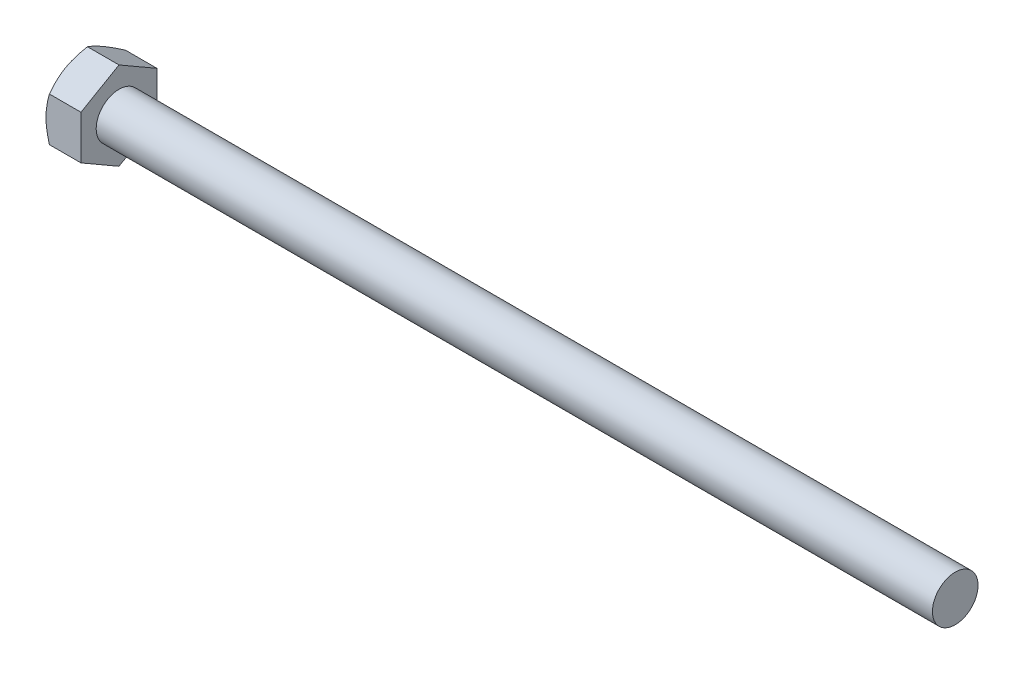
ISO-10303-21;
HEADER;
FILE_DESCRIPTION(('STEP AP214'),'2;1');
FILE_NAME('part.step','',(''),(''),'','','');
FILE_SCHEMA(('AUTOMOTIVE_DESIGN { 1 0 10303 214 1 1 1 1 }'));
ENDSEC;
DATA;
#1=APPLICATION_CONTEXT('core data for automotive mechanical design processes');
#2=APPLICATION_PROTOCOL_DEFINITION('international standard','automotive_design',2000,#1);
#3=PRODUCT_CONTEXT('',#1,'mechanical');
#4=PRODUCT('Part','Part','',(#3));
#5=PRODUCT_RELATED_PRODUCT_CATEGORY('part','',(#4));
#6=PRODUCT_DEFINITION_FORMATION('','',#4);
#7=PRODUCT_DEFINITION_CONTEXT('part definition',#1,'design');
#8=PRODUCT_DEFINITION('design','',#6,#7);
#9=PRODUCT_DEFINITION_SHAPE('','',#8);
#10=(LENGTH_UNIT() NAMED_UNIT(*) SI_UNIT(.MILLI.,.METRE.));
#11=(NAMED_UNIT(*) PLANE_ANGLE_UNIT() SI_UNIT($,.RADIAN.));
#12=(NAMED_UNIT(*) SI_UNIT($,.STERADIAN.) SOLID_ANGLE_UNIT());
#13=UNCERTAINTY_MEASURE_WITH_UNIT(LENGTH_MEASURE(1.E-05),#10,'distance_accuracy_value','');
#14=(GEOMETRIC_REPRESENTATION_CONTEXT(3) GLOBAL_UNCERTAINTY_ASSIGNED_CONTEXT((#13)) GLOBAL_UNIT_ASSIGNED_CONTEXT((#10,
#11,#12)) REPRESENTATION_CONTEXT('',''));
#15=CARTESIAN_POINT('',(0.,0.,0.));
#16=DIRECTION('',(0.,0.,1.));
#17=DIRECTION('',(1.,0.,0.));
#18=AXIS2_PLACEMENT_3D('',#15,#16,#17);
#19=CARTESIAN_POINT('',(2.3,1.5,0.));
#20=DIRECTION('',(-1.,0.,0.));
#21=DIRECTION('',(0.,0.,1.));
#22=AXIS2_PLACEMENT_3D('',#19,#20,#21);
#23=PLANE('',#22);
#24=CARTESIAN_POINT('',(2.3,0.,0.));
#25=DIRECTION('',(-1.,0.,0.));
#26=DIRECTION('',(0.,0.,1.));
#27=AXIS2_PLACEMENT_3D('',#24,#25,#26);
#28=CIRCLE('',#27,1.5);
#29=CARTESIAN_POINT('',(2.3,0.,1.5));
#30=VERTEX_POINT('',#29);
#31=EDGE_CURVE('E199',#30,#30,#28,.T.);
#32=ORIENTED_EDGE('',*,*,#31,.T.);
#33=EDGE_LOOP('',(#32));
#34=FACE_BOUND('',#33,.T.);
#35=DIRECTION('',(0.,1.,0.));
#36=VECTOR('',#35,1.);
#37=CARTESIAN_POINT('',(2.3,-1.44337567928133,2.5));
#38=LINE('',#37,#36);
#39=CARTESIAN_POINT('',(2.3,-1.44337567928133,2.5));
#40=VERTEX_POINT('',#39);
#41=CARTESIAN_POINT('',(2.3,1.44337567928159,2.5));
#42=VERTEX_POINT('',#41);
#43=EDGE_CURVE('E59',#40,#42,#38,.T.);
#44=ORIENTED_EDGE('',*,*,#43,.F.);
#45=DIRECTION('',(0.,0.50000000163871,0.866025402838329));
#46=VECTOR('',#45,1.);
#47=CARTESIAN_POINT('',(2.3,-2.8867513585628,0.));
#48=LINE('',#47,#46);
#49=CARTESIAN_POINT('',(2.3,-2.8867513585628,0.));
#50=VERTEX_POINT('',#49);
#51=EDGE_CURVE('E132',#50,#40,#48,.T.);
#52=ORIENTED_EDGE('',*,*,#51,.F.);
#53=DIRECTION('',(0.,-0.50000000163871,0.866025402838329));
#54=VECTOR('',#53,1.);
#55=CARTESIAN_POINT('',(2.3,-1.44337567928133,-2.5));
#56=LINE('',#55,#54);
#57=CARTESIAN_POINT('',(2.3,-1.44337567928133,-2.5));
#58=VERTEX_POINT('',#57);
#59=EDGE_CURVE('E130',#58,#50,#56,.T.);
#60=ORIENTED_EDGE('',*,*,#59,.F.);
#61=DIRECTION('',(0.,-1.,0.));
#62=VECTOR('',#61,1.);
#63=CARTESIAN_POINT('',(2.3,1.44337567928159,-2.5));
#64=LINE('',#63,#62);
#65=CARTESIAN_POINT('',(2.3,1.44337567928159,-2.5));
#66=VERTEX_POINT('',#65);
#67=EDGE_CURVE('E113',#66,#58,#64,.T.);
#68=ORIENTED_EDGE('',*,*,#67,.F.);
#69=DIRECTION('',(0.,-0.50000000163871,-0.866025402838329));
#70=VECTOR('',#69,1.);
#71=CARTESIAN_POINT('',(2.3,2.88675135856305,0.));
#72=LINE('',#71,#70);
#73=CARTESIAN_POINT('',(2.3,2.88675135856305,0.));
#74=VERTEX_POINT('',#73);
#75=EDGE_CURVE('E122',#74,#66,#72,.T.);
#76=ORIENTED_EDGE('',*,*,#75,.F.);
#77=DIRECTION('',(0.,0.50000000163871,-0.866025402838329));
#78=VECTOR('',#77,1.);
#79=CARTESIAN_POINT('',(2.3,1.44337567928159,2.5));
#80=LINE('',#79,#78);
#81=EDGE_CURVE('E126',#42,#74,#80,.T.);
#82=ORIENTED_EDGE('',*,*,#81,.F.);
#83=EDGE_LOOP('',(#44,#52,#60,#68,#76,#82));
#84=FACE_BOUND('',#83,.T.);
#85=ADVANCED_FACE('F36',(#34,#84),#23,.F.);
#86=CARTESIAN_POINT('',(-25.4,0.,0.));
#87=DIRECTION('',(-1.,0.,0.));
#88=DIRECTION('',(0.,0.,1.));
#89=AXIS2_PLACEMENT_3D('',#86,#87,#88);
#90=CYLINDRICAL_SURFACE('',#89,1.5);
#91=CARTESIAN_POINT('',(57.3,0.,0.));
#92=DIRECTION('',(-1.,0.,0.));
#93=DIRECTION('',(0.,0.,1.));
#94=AXIS2_PLACEMENT_3D('',#91,#92,#93);
#95=CIRCLE('',#94,1.5);
#96=CARTESIAN_POINT('',(57.3,0.,1.5));
#97=VERTEX_POINT('',#96);
#98=EDGE_CURVE('E11',#97,#97,#95,.T.);
#99=ORIENTED_EDGE('',*,*,#98,.T.);
#100=EDGE_LOOP('',(#99));
#101=FACE_BOUND('',#100,.T.);
#102=ORIENTED_EDGE('',*,*,#31,.F.);
#103=EDGE_LOOP('',(#102));
#104=FACE_BOUND('',#103,.T.);
#105=ADVANCED_FACE('F38',(#101,#104),#90,.T.);
#106=CARTESIAN_POINT('',(57.3,1.5,0.));
#107=DIRECTION('',(1.,0.,0.));
#108=DIRECTION('',(0.,0.,-1.));
#109=AXIS2_PLACEMENT_3D('',#106,#107,#108);
#110=PLANE('',#109);
#111=ORIENTED_EDGE('',*,*,#98,.F.);
#112=EDGE_LOOP('',(#111));
#113=FACE_BOUND('',#112,.T.);
#114=ADVANCED_FACE('F180',(#113),#110,.T.);
#115=CARTESIAN_POINT('',(2.3,-1.44337567928133,2.5));
#116=DIRECTION('',(0.,0.,1.));
#117=DIRECTION('',(0.,-1.,0.));
#118=AXIS2_PLACEMENT_3D('',#115,#116,#117);
#119=PLANE('',#118);
#120=DIRECTION('',(-1.,0.,0.));
#121=VECTOR('',#120,1.);
#122=CARTESIAN_POINT('',(2.3,-1.44337567928133,2.5));
#123=LINE('',#122,#121);
#124=CARTESIAN_POINT('',(0.223290995513354,-1.44337567928133,2.5));
#125=VERTEX_POINT('',#124);
#126=EDGE_CURVE('E139',#40,#125,#123,.T.);
#127=ORIENTED_EDGE('',*,*,#126,.F.);
#128=ORIENTED_EDGE('',*,*,#43,.T.);
#129=DIRECTION('',(-1.,0.,0.));
#130=VECTOR('',#129,1.);
#131=CARTESIAN_POINT('',(2.3,1.44337567928159,2.5));
#132=LINE('',#131,#130);
#133=CARTESIAN_POINT('',(0.223290995513429,1.44337567928159,2.5));
#134=VERTEX_POINT('',#133);
#135=EDGE_CURVE('E138',#42,#134,#132,.T.);
#136=ORIENTED_EDGE('',*,*,#135,.T.);
#137=CARTESIAN_POINT('',(1.19632004406595,-3.82805178069449,2.5));
#138=CARTESIAN_POINT('',(1.14327589629636,-3.7182875906123,2.5));
#139=CARTESIAN_POINT('',(1.09075904917703,-3.60826388251005,2.5));
#140=CARTESIAN_POINT('',(0.987081273872628,-3.38755710903453,2.5));
#141=CARTESIAN_POINT('',(0.935920580448254,-3.27687393351173,2.5));
#142=CARTESIAN_POINT('',(0.834986914311904,-3.05411000573681,2.5));
#143=CARTESIAN_POINT('',(0.785223558317014,-2.94202488038616,2.5));
#144=CARTESIAN_POINT('',(0.687834293242499,-2.71693339089507,2.5));
#145=CARTESIAN_POINT('',(0.64020827274816,-2.60392707513802,2.5));
#146=CARTESIAN_POINT('',(0.547096599216495,-2.37541055612811,2.5));
#147=CARTESIAN_POINT('',(0.501644402476205,-2.25988664554279,2.5));
#148=CARTESIAN_POINT('',(0.414299798759198,-2.02747621227372,2.5));
#149=CARTESIAN_POINT('',(0.372407787833691,-1.91058953963062,2.5));
#150=CARTESIAN_POINT('',(0.293309177636011,-1.67550769213624,2.5));
#151=CARTESIAN_POINT('',(0.25609261725792,-1.55731590352552,2.5));
#152=CARTESIAN_POINT('',(0.187553577101156,-1.31925207497197,2.5));
#153=CARTESIAN_POINT('',(0.156229233411223,-1.19938057931484,2.5));
#154=CARTESIAN_POINT('',(0.100995335359192,-0.957875466950475,2.5));
#155=CARTESIAN_POINT('',(0.0770877549190804,-0.836241390144261,2.5));
#156=CARTESIAN_POINT('',(0.0382970673549973,-0.591506739851933,2.5));
#157=CARTESIAN_POINT('',(0.0234139682023207,-0.468406165070562,2.5));
#158=CARTESIAN_POINT('',(0.00398887707067176,-0.222162283708564,2.5));
#159=CARTESIAN_POINT('',(-0.000618582954530851,-0.0990242760150258,2.5));
#160=CARTESIAN_POINT('',(0.000752385125691248,0.147165525321938,2.5));
#161=CARTESIAN_POINT('',(0.00672806531326748,0.270217333048273,2.5));
#162=CARTESIAN_POINT('',(0.0255487226845901,0.480345911839685,2.5));
#163=CARTESIAN_POINT('',(0.0359427194182765,0.567654504214298,2.5));
#164=CARTESIAN_POINT('',(0.0613825749513618,0.741597260879313,2.5));
#165=CARTESIAN_POINT('',(0.0764291673933814,0.828231316595431,2.5));
#166=CARTESIAN_POINT('',(0.127758160854863,1.0870510539617,2.5));
#167=CARTESIAN_POINT('',(0.170216562336702,1.258023566365,2.5));
#168=CARTESIAN_POINT('',(0.243445888381077,1.51385794210056,2.5));
#169=CARTESIAN_POINT('',(0.269819264012639,1.60005333907683,2.5));
#170=CARTESIAN_POINT('',(0.325175689355996,1.7715444847852,2.5));
#171=CARTESIAN_POINT('',(0.354156939094442,1.8568408093229,2.5));
#172=CARTESIAN_POINT('',(0.414126062328043,2.02617712827433,2.5));
#173=CARTESIAN_POINT('',(0.445101723039576,2.11022149180121,2.5));
#174=CARTESIAN_POINT('',(0.508871156887617,2.27765814571535,2.5));
#175=CARTESIAN_POINT('',(0.541665664837585,2.36105015679791,2.5));
#176=CARTESIAN_POINT('',(0.575190110848553,2.44414064056434,2.5));
#177=B_SPLINE_CURVE_WITH_KNOTS('',3,(#137,#138,#139,#140,#141,#142,#143,#144,#145,#146,#147,
#148,#149,#150,#151,#152,#153,#154,#155,#156,#157,#158,#159,#160,#161,#162,#163,#164,#165,#166,
#167,#168,#169,#170,#171,#172,#173,#174,#175,#176),.UNSPECIFIED.,.F.,.F.,(4,2,2,2,2,2,2,2,2,2,2,
2,2,2,2,2,2,2,2,4),(0.,0.365732583178816,0.731528069426235,1.0994168436567,1.46728641830588,
1.83967239293614,2.21209973939173,2.58371966044213,2.95522182687511,3.32682278147237,
3.69842406430308,4.06765095845392,4.43678199670504,4.70042859172476,4.96411678096691,
5.49188560395094,5.76228383952689,6.03249685521827,6.30118893346184,6.56999036530353),.UNSPECIFIED.);
#178=CARTESIAN_POINT('',(0.,0.,2.5));
#179=VERTEX_POINT('',#178);
#180=EDGE_CURVE('E182',#179,#134,#177,.T.);
#181=ORIENTED_EDGE('',*,*,#180,.F.);
#182=EDGE_CURVE('E190',#125,#179,#177,.T.);
#183=ORIENTED_EDGE('',*,*,#182,.F.);
#184=EDGE_LOOP('',(#127,#128,#136,#181,#183));
#185=FACE_BOUND('',#184,.T.);
#186=ADVANCED_FACE('F176',(#185),#119,.T.);
#187=CARTESIAN_POINT('',(2.3,-2.8867513585628,0.));
#188=DIRECTION('',(0.,-0.866025402838329,0.500000001638711));
#189=DIRECTION('',(0.,-0.500000001638711,-0.866025402838329));
#190=AXIS2_PLACEMENT_3D('',#187,#188,#189);
#191=PLANE('',#190);
#192=DIRECTION('',(-1.,0.,0.));
#193=VECTOR('',#192,1.);
#194=CARTESIAN_POINT('',(2.3,-2.8867513585628,0.));
#195=LINE('',#194,#193);
#196=CARTESIAN_POINT('',(0.223291000975683,-2.8867513585628,0.));
#197=VERTEX_POINT('',#196);
#198=EDGE_CURVE('E143',#50,#197,#195,.T.);
#199=ORIENTED_EDGE('',*,*,#198,.F.);
#200=ORIENTED_EDGE('',*,*,#51,.T.);
#201=ORIENTED_EDGE('',*,*,#126,.T.);
#202=CARTESIAN_POINT('',(0.223357671642481,-2.88686682861714,-0.000199999999997055));
#203=CARTESIAN_POINT('',(0.186721627123144,-2.823437260003,0.109663235061774));
#204=CARTESIAN_POINT('',(0.153402225713998,-2.75946017255779,0.220474800552927));
#205=CARTESIAN_POINT('',(0.0952422917887059,-2.63039811834957,0.444016834793913));
#206=CARTESIAN_POINT('',(0.0704223351272887,-2.5653108579734,0.556751276198274));
#207=CARTESIAN_POINT('',(0.0317856569546165,-2.43594298952786,0.780822996233662));
#208=CARTESIAN_POINT('',(0.0177118014837245,-2.37168228872263,0.892125794471919));
#209=CARTESIAN_POINT('',(0.000909157269638142,-2.24285844798616,1.1152552308786));
#210=CARTESIAN_POINT('',(-0.0018335440453357,-2.17829577643781,1.22708105778404));
#211=CARTESIAN_POINT('',(0.00386576449219316,-2.05765213161006,1.43604197932287));
#212=CARTESIAN_POINT('',(0.0109083986955485,-2.00155311785805,1.53320832097125));
#213=CARTESIAN_POINT('',(0.0332314230427739,-1.88972058300822,1.72690795242393));
#214=CARTESIAN_POINT('',(0.0485194421325141,-1.83398744884957,1.82344057202992));
#215=CARTESIAN_POINT('',(0.0867390970453044,-1.7219242510559,2.01753972341901));
#216=CARTESIAN_POINT('',(0.109832779058663,-1.66560837412358,2.11508168311234));
#217=CARTESIAN_POINT('',(0.162246658960904,-1.55381666130744,2.3087106087289));
#218=CARTESIAN_POINT('',(0.191554537725398,-1.49833939269559,2.40480005620986));
#219=CARTESIAN_POINT('',(0.223357666179496,-1.44326020922699,2.5002));
#220=B_SPLINE_CURVE_WITH_KNOTS('',3,(#202,#203,#204,#205,#206,#207,#208,#209,#210,#211,#212,
#213,#214,#215,#216,#217,#218,#219),.UNSPECIFIED.,.F.,.F.,(4,2,2,2,2,2,2,2,4),(0.,
0.396285829073731,0.793524333587547,1.18093087363639,1.56786160813528,1.90479742383017,
2.24204552159359,2.58677531937551,2.93082800409491),.UNSPECIFIED.);
#221=CARTESIAN_POINT('',(0.,-2.16506351419155,1.2500000081935));
#222=VERTEX_POINT('',#221);
#223=EDGE_CURVE('E192',#222,#125,#220,.T.);
#224=ORIENTED_EDGE('',*,*,#223,.F.);
#225=EDGE_CURVE('E191',#197,#222,#220,.T.);
#226=ORIENTED_EDGE('',*,*,#225,.F.);
#227=EDGE_LOOP('',(#199,#200,#201,#224,#226));
#228=FACE_BOUND('',#227,.T.);
#229=ADVANCED_FACE('F179',(#228),#191,.T.);
#230=CARTESIAN_POINT('',(2.3,-1.44337567928133,-2.5));
#231=DIRECTION('',(0.,-0.866025402838329,-0.50000000163871));
#232=DIRECTION('',(0.,0.50000000163871,-0.866025402838329));
#233=AXIS2_PLACEMENT_3D('',#230,#231,#232);
#234=PLANE('',#233);
#235=DIRECTION('',(-1.,0.,0.));
#236=VECTOR('',#235,1.);
#237=CARTESIAN_POINT('',(2.3,-1.44337567928133,-2.5));
#238=LINE('',#237,#236);
#239=CARTESIAN_POINT('',(0.223290995513354,-1.44337567928133,-2.5));
#240=VERTEX_POINT('',#239);
#241=EDGE_CURVE('E119',#58,#240,#238,.T.);
#242=ORIENTED_EDGE('',*,*,#241,.F.);
#243=ORIENTED_EDGE('',*,*,#59,.T.);
#244=ORIENTED_EDGE('',*,*,#198,.T.);
#245=CARTESIAN_POINT('',(0.223357666179496,-1.44326020922699,-2.5002));
#246=CARTESIAN_POINT('',(0.186721622105297,-1.5066897776876,-2.39033676520415));
#247=CARTESIAN_POINT('',(0.153402221169772,-1.57066686497833,-2.27952519998057));
#248=CARTESIAN_POINT('',(0.0952422882291764,-1.69972891886277,-2.05598316630038));
#249=CARTESIAN_POINT('',(0.0704223320783219,-1.76481617906955,-1.94324872518942));
#250=CARTESIAN_POINT('',(0.0317856549217424,-1.89418404716996,-1.71917700575181));
#251=CARTESIAN_POINT('',(0.0177117999573057,-1.95844474779998,-1.60787420781702));
#252=CARTESIAN_POINT('',(0.00090915671970467,-2.08726858816535,-1.38474477205312));
#253=CARTESIAN_POINT('',(-0.00183354412493002,-2.15183125951782,-1.27291894548693));
#254=CARTESIAN_POINT('',(0.00386576523131279,-2.27247490433789,-1.0639580239614));
#255=CARTESIAN_POINT('',(0.0109083998520694,-2.3285739182796,-0.966791681984465));
#256=CARTESIAN_POINT('',(0.0332314250552663,-2.44040645349358,-0.773092049901063));
#257=CARTESIAN_POINT('',(0.048519444583664,-2.49613958782666,-0.676559429992934));
#258=CARTESIAN_POINT('',(0.0867391003778061,-2.60820278596567,-0.48246027800571));
#259=CARTESIAN_POINT('',(0.109832782834311,-2.66451866306856,-0.384918318016938));
#260=CARTESIAN_POINT('',(0.162246663600414,-2.77631037621612,-0.191289391826346));
#261=CARTESIAN_POINT('',(0.19155454278545,-2.83178764498885,-0.0951999440667246));
#262=CARTESIAN_POINT('',(0.223357671642481,-2.88686682861714,0.000200000000003285));
#263=B_SPLINE_CURVE_WITH_KNOTS('',3,(#245,#246,#247,#248,#249,#250,#251,#252,#253,#254,#255,
#256,#257,#258,#259,#260,#261,#262),.UNSPECIFIED.,.F.,.F.,(4,2,2,2,2,2,2,2,4),(0.,
0.396285827816312,0.793524331042151,1.18093086988015,1.56786160317875,1.90479742008592,
2.24204551906553,2.58677531811864,2.9308280040949),.UNSPECIFIED.);
#264=CARTESIAN_POINT('',(0.,-2.16506351419155,-1.25000000819349));
#265=VERTEX_POINT('',#264);
#266=EDGE_CURVE('E222',#265,#197,#263,.T.);
#267=ORIENTED_EDGE('',*,*,#266,.F.);
#268=EDGE_CURVE('E227',#240,#265,#263,.T.);
#269=ORIENTED_EDGE('',*,*,#268,.F.);
#270=EDGE_LOOP('',(#242,#243,#244,#267,#269));
#271=FACE_BOUND('',#270,.T.);
#272=ADVANCED_FACE('F298',(#271),#234,.T.);
#273=CARTESIAN_POINT('',(2.3,1.44337567928159,-2.5));
#274=DIRECTION('',(0.,0.,-1.));
#275=DIRECTION('',(0.,1.,0.));
#276=AXIS2_PLACEMENT_3D('',#273,#274,#275);
#277=PLANE('',#276);
#278=DIRECTION('',(-1.,0.,0.));
#279=VECTOR('',#278,1.);
#280=CARTESIAN_POINT('',(2.3,1.44337567928159,-2.5));
#281=LINE('',#280,#279);
#282=CARTESIAN_POINT('',(0.223290995513426,1.44337567928159,-2.5));
#283=VERTEX_POINT('',#282);
#284=EDGE_CURVE('E108',#66,#283,#281,.T.);
#285=ORIENTED_EDGE('',*,*,#284,.F.);
#286=ORIENTED_EDGE('',*,*,#67,.T.);
#287=ORIENTED_EDGE('',*,*,#241,.T.);
#288=CARTESIAN_POINT('',(1.19632004406595,-3.82805178069449,-2.5));
#289=CARTESIAN_POINT('',(1.14327589629636,-3.71828759061229,-2.5));
#290=CARTESIAN_POINT('',(1.09075904917703,-3.60826388251005,-2.5));
#291=CARTESIAN_POINT('',(0.987081273872629,-3.38755710903453,-2.5));
#292=CARTESIAN_POINT('',(0.935920580448254,-3.27687393351173,-2.5));
#293=CARTESIAN_POINT('',(0.834986914311905,-3.05411000573681,-2.5));
#294=CARTESIAN_POINT('',(0.785223558317014,-2.94202488038616,-2.5));
#295=CARTESIAN_POINT('',(0.687834293242499,-2.71693339089507,-2.5));
#296=CARTESIAN_POINT('',(0.64020827274816,-2.60392707513802,-2.5));
#297=CARTESIAN_POINT('',(0.547096599216495,-2.3754105561281,-2.5));
#298=CARTESIAN_POINT('',(0.501644402476205,-2.25988664554279,-2.5));
#299=CARTESIAN_POINT('',(0.414299798759198,-2.02747621227372,-2.5));
#300=CARTESIAN_POINT('',(0.372407787833692,-1.91058953963062,-2.5));
#301=CARTESIAN_POINT('',(0.293309177636011,-1.67550769213624,-2.5));
#302=CARTESIAN_POINT('',(0.25609261725792,-1.55731590352552,-2.5));
#303=CARTESIAN_POINT('',(0.187553577101155,-1.31925207497197,-2.5));
#304=CARTESIAN_POINT('',(0.156229233411223,-1.19938057931484,-2.5));
#305=CARTESIAN_POINT('',(0.100995335359191,-0.957875466950474,-2.5));
#306=CARTESIAN_POINT('',(0.0770877549190793,-0.836241390144261,-2.5));
#307=CARTESIAN_POINT('',(0.0382970673549961,-0.591506739851933,-2.5));
#308=CARTESIAN_POINT('',(0.0234139682023195,-0.468406165070563,-2.5));
#309=CARTESIAN_POINT('',(0.00398887707067026,-0.222162283708564,-2.5));
#310=CARTESIAN_POINT('',(-0.000618582954532723,-0.099024276015026,-2.5));
#311=CARTESIAN_POINT('',(0.000752385125689055,0.147165525321938,-2.5));
#312=CARTESIAN_POINT('',(0.00672806531326533,0.270217333048273,-2.5));
#313=CARTESIAN_POINT('',(0.0255487226845878,0.480345911839685,-2.5));
#314=CARTESIAN_POINT('',(0.0359427194182741,0.567654504214298,-2.5));
#315=CARTESIAN_POINT('',(0.0613825749513591,0.741597260879313,-2.5));
#316=CARTESIAN_POINT('',(0.0764291673933784,0.82823131659543,-2.5));
#317=CARTESIAN_POINT('',(0.127758160854859,1.0870510539617,-2.5));
#318=CARTESIAN_POINT('',(0.170216562336698,1.25802356636499,-2.5));
#319=CARTESIAN_POINT('',(0.243445888381073,1.51385794210056,-2.5));
#320=CARTESIAN_POINT('',(0.269819264012635,1.60005333907683,-2.5));
#321=CARTESIAN_POINT('',(0.325175689355992,1.77154448478519,-2.5));
#322=CARTESIAN_POINT('',(0.354156939094438,1.85684080932289,-2.5));
#323=CARTESIAN_POINT('',(0.414126062328038,2.02617712827432,-2.5));
#324=CARTESIAN_POINT('',(0.445101723039571,2.1102214918012,-2.5));
#325=CARTESIAN_POINT('',(0.508871156887612,2.27765814571535,-2.5));
#326=CARTESIAN_POINT('',(0.541665664837579,2.36105015679791,-2.5));
#327=CARTESIAN_POINT('',(0.575190110848547,2.44414064056433,-2.5));
#328=B_SPLINE_CURVE_WITH_KNOTS('',3,(#288,#289,#290,#291,#292,#293,#294,#295,#296,#297,#298,
#299,#300,#301,#302,#303,#304,#305,#306,#307,#308,#309,#310,#311,#312,#313,#314,#315,#316,#317,
#318,#319,#320,#321,#322,#323,#324,#325,#326,#327),.UNSPECIFIED.,.F.,.F.,(4,2,2,2,2,2,2,2,2,2,2,
2,2,2,2,2,2,2,2,4),(0.,0.365732583178816,0.731528069426236,1.0994168436567,1.46728641830589,
1.83967239293614,2.21209973939173,2.58371966044213,2.95522182687511,3.32682278147237,
3.69842406430308,4.06765095845392,4.43678199670504,4.70042859172476,4.96411678096691,
5.49188560395093,5.76228383952689,6.03249685521826,6.30118893346183,6.56999036530352),.UNSPECIFIED.);
#329=CARTESIAN_POINT('',(0.,0.,-2.5));
#330=VERTEX_POINT('',#329);
#331=EDGE_CURVE('E223',#330,#240,#328,.F.);
#332=ORIENTED_EDGE('',*,*,#331,.F.);
#333=EDGE_CURVE('E116',#283,#330,#328,.F.);
#334=ORIENTED_EDGE('',*,*,#333,.F.);
#335=EDGE_LOOP('',(#285,#286,#287,#332,#334));
#336=FACE_BOUND('',#335,.T.);
#337=ADVANCED_FACE('F110',(#336),#277,.T.);
#338=CARTESIAN_POINT('',(2.3,2.88675135856305,0.));
#339=DIRECTION('',(0.,0.866025402838329,-0.50000000163871));
#340=DIRECTION('',(0.,0.50000000163871,0.866025402838329));
#341=AXIS2_PLACEMENT_3D('',#338,#339,#340);
#342=PLANE('',#341);
#343=DIRECTION('',(-1.,0.,0.));
#344=VECTOR('',#343,1.);
#345=CARTESIAN_POINT('',(2.3,2.88675135856305,0.));
#346=LINE('',#345,#344);
#347=CARTESIAN_POINT('',(0.223291000975831,2.88675135856305,0.));
#348=VERTEX_POINT('',#347);
#349=EDGE_CURVE('E51',#74,#348,#346,.T.);
#350=ORIENTED_EDGE('',*,*,#349,.F.);
#351=ORIENTED_EDGE('',*,*,#75,.T.);
#352=ORIENTED_EDGE('',*,*,#284,.T.);
#353=CARTESIAN_POINT('',(0.223357671642628,2.88686682861739,0.000200000000002865));
#354=CARTESIAN_POINT('',(0.186721627123289,2.82343726000325,-0.109663235061778));
#355=CARTESIAN_POINT('',(0.15340222571414,2.75946017255803,-0.22047480055294));
#356=CARTESIAN_POINT('',(0.0952422917888422,2.6303981183498,-0.444016834793946));
#357=CARTESIAN_POINT('',(0.0704223351274228,2.56531085797362,-0.556751276198317));
#358=CARTESIAN_POINT('',(0.0317856569547468,2.43594298952807,-0.780822996233725));
#359=CARTESIAN_POINT('',(0.0177118014838533,2.37168228872284,-0.892125794471992));
#360=CARTESIAN_POINT('',(0.000909157269765117,2.24285844798636,-1.11525523087869));
#361=CARTESIAN_POINT('',(-0.00183354404520911,2.17829577643801,-1.22708105778415));
#362=CARTESIAN_POINT('',(0.00386576449231955,2.05765213161025,-1.43604197932297));
#363=CARTESIAN_POINT('',(0.0109083986956732,2.00155311785825,-1.53320832097134));
#364=CARTESIAN_POINT('',(0.033231423042893,1.88972058300843,-1.726907952424));
#365=CARTESIAN_POINT('',(0.0485194421326293,1.83398744884979,-1.82344057202999));
#366=CARTESIAN_POINT('',(0.0867390970454098,1.72192425105612,-2.01753972341906));
#367=CARTESIAN_POINT('',(0.109832779058763,1.66560837412381,-2.11508168311237));
#368=CARTESIAN_POINT('',(0.16224665896099,1.55381666130769,-2.30871060872891));
#369=CARTESIAN_POINT('',(0.191554537725478,1.49833939269584,-2.40480005620987));
#370=CARTESIAN_POINT('',(0.223357666179568,1.44326020922725,-2.5002));
#371=B_SPLINE_CURVE_WITH_KNOTS('',3,(#353,#354,#355,#356,#357,#358,#359,#360,#361,#362,#363,
#364,#365,#366,#367,#368,#369,#370),.UNSPECIFIED.,.F.,.F.,(4,2,2,2,2,2,2,2,4),(0.,
0.396285829073766,0.793524333587617,1.1809308736365,1.56786160813542,1.90479742383028,
2.24204552159366,2.58677531937554,2.93082800409491),.UNSPECIFIED.);
#372=CARTESIAN_POINT('',(0.,2.16506351419174,-1.2500000081936));
#373=VERTEX_POINT('',#372);
#374=EDGE_CURVE('E158',#373,#283,#371,.T.);
#375=ORIENTED_EDGE('',*,*,#374,.F.);
#376=EDGE_CURVE('E286',#348,#373,#371,.T.);
#377=ORIENTED_EDGE('',*,*,#376,.F.);
#378=EDGE_LOOP('',(#350,#351,#352,#375,#377));
#379=FACE_BOUND('',#378,.T.);
#380=ADVANCED_FACE('F123',(#379),#342,.T.);
#381=CARTESIAN_POINT('',(2.3,1.44337567928159,2.5));
#382=DIRECTION('',(0.,0.866025402838329,0.50000000163871));
#383=DIRECTION('',(0.,-0.50000000163871,0.866025402838329));
#384=AXIS2_PLACEMENT_3D('',#381,#382,#383);
#385=PLANE('',#384);
#386=ORIENTED_EDGE('',*,*,#135,.F.);
#387=ORIENTED_EDGE('',*,*,#81,.T.);
#388=ORIENTED_EDGE('',*,*,#349,.T.);
#389=CARTESIAN_POINT('',(0.223357666179571,1.44326020922725,2.5002));
#390=CARTESIAN_POINT('',(0.186721622105376,1.50668977768786,2.39033676520415));
#391=CARTESIAN_POINT('',(0.153402221169854,1.57066686497859,2.27952519998056));
#392=CARTESIAN_POINT('',(0.0952422882292661,1.69972891886304,2.05598316630036));
#393=CARTESIAN_POINT('',(0.0704223320784162,1.76481617906983,1.94324872518939));
#394=CARTESIAN_POINT('',(0.0317856549218469,1.89418404717024,1.71917700575177));
#395=CARTESIAN_POINT('',(0.0177117999574159,1.95844474780027,1.60787420781697));
#396=CARTESIAN_POINT('',(0.000909156719826574,2.08726858816564,1.38474477205306));
#397=CARTESIAN_POINT('',(-0.00183354412480209,2.15183125951811,1.27291894548687));
#398=CARTESIAN_POINT('',(0.00386576523145182,2.27247490433819,1.06395802396134));
#399=CARTESIAN_POINT('',(0.0109083998522126,2.32857391827989,0.966791681984408));
#400=CARTESIAN_POINT('',(0.0332314250554153,2.44040645349386,0.773092049901018));
#401=CARTESIAN_POINT('',(0.0485194445838148,2.49613958782694,0.676559429992895));
#402=CARTESIAN_POINT('',(0.0867391003779589,2.60820278596594,0.482460278005685));
#403=CARTESIAN_POINT('',(0.109832782834464,2.66451866306883,0.38491831801692));
#404=CARTESIAN_POINT('',(0.162246663600566,2.77631037621638,0.19128939182634));
#405=CARTESIAN_POINT('',(0.1915545427856,2.83178764498911,0.095199944066725));
#406=CARTESIAN_POINT('',(0.223357671642629,2.88686682861739,-0.000199999999997085));
#407=B_SPLINE_CURVE_WITH_KNOTS('',3,(#389,#390,#391,#392,#393,#394,#395,#396,#397,#398,#399,
#400,#401,#402,#403,#404,#405,#406),.UNSPECIFIED.,.F.,.F.,(4,2,2,2,2,2,2,2,4),(0.,
0.396285827816331,0.793524331042187,1.1809308698802,1.56786160317882,1.90479742008597,
2.24204551906556,2.58677531811865,2.93082800409489),.UNSPECIFIED.);
#408=CARTESIAN_POINT('',(0.,2.16506351419174,1.25000000819361));
#409=VERTEX_POINT('',#408);
#410=EDGE_CURVE('E142',#409,#348,#407,.T.);
#411=ORIENTED_EDGE('',*,*,#410,.F.);
#412=EDGE_CURVE('E157',#134,#409,#407,.T.);
#413=ORIENTED_EDGE('',*,*,#412,.F.);
#414=EDGE_LOOP('',(#386,#387,#388,#411,#413));
#415=FACE_BOUND('',#414,.T.);
#416=ADVANCED_FACE('F169',(#415),#385,.T.);
#417=CARTESIAN_POINT('',(0.,0.,0.));
#418=DIRECTION('',(1.,0.,0.));
#419=DIRECTION('',(0.,0.,-1.));
#420=AXIS2_PLACEMENT_3D('',#417,#418,#419);
#421=CONICAL_SURFACE('',#420,2.5,1.0471975511966);
#422=CARTESIAN_POINT('',(0.,0.,0.));
#423=DIRECTION('',(-1.,0.,0.));
#424=DIRECTION('',(0.,0.,1.));
#425=AXIS2_PLACEMENT_3D('',#422,#423,#424);
#426=CIRCLE('',#425,2.5);
#427=EDGE_CURVE('E201',#222,#179,#426,.T.);
#428=ORIENTED_EDGE('',*,*,#427,.F.);
#429=ORIENTED_EDGE('',*,*,#223,.T.);
#430=ORIENTED_EDGE('',*,*,#182,.T.);
#431=EDGE_LOOP('',(#428,#429,#430));
#432=FACE_BOUND('',#431,.T.);
#433=ADVANCED_FACE('F173',(#432),#421,.T.);
#434=EDGE_CURVE('E209',#265,#222,#426,.T.);
#435=ORIENTED_EDGE('',*,*,#434,.F.);
#436=ORIENTED_EDGE('',*,*,#266,.T.);
#437=ORIENTED_EDGE('',*,*,#225,.T.);
#438=EDGE_LOOP('',(#435,#436,#437));
#439=FACE_BOUND('',#438,.T.);
#440=ADVANCED_FACE('F232',(#439),#421,.T.);
#441=ORIENTED_EDGE('',*,*,#331,.T.);
#442=ORIENTED_EDGE('',*,*,#268,.T.);
#443=EDGE_CURVE('E212',#330,#265,#426,.T.);
#444=ORIENTED_EDGE('',*,*,#443,.F.);
#445=EDGE_LOOP('',(#441,#442,#444));
#446=FACE_BOUND('',#445,.T.);
#447=ADVANCED_FACE('F165',(#446),#421,.T.);
#448=ORIENTED_EDGE('',*,*,#374,.T.);
#449=ORIENTED_EDGE('',*,*,#333,.T.);
#450=EDGE_CURVE('E208',#373,#330,#426,.T.);
#451=ORIENTED_EDGE('',*,*,#450,.F.);
#452=EDGE_LOOP('',(#448,#449,#451));
#453=FACE_BOUND('',#452,.T.);
#454=ADVANCED_FACE('F221',(#453),#421,.T.);
#455=EDGE_CURVE('E44',#179,#409,#426,.T.);
#456=ORIENTED_EDGE('',*,*,#455,.F.);
#457=ORIENTED_EDGE('',*,*,#180,.T.);
#458=ORIENTED_EDGE('',*,*,#412,.T.);
#459=EDGE_LOOP('',(#456,#457,#458));
#460=FACE_BOUND('',#459,.T.);
#461=ADVANCED_FACE('F260',(#460),#421,.T.);
#462=CARTESIAN_POINT('',(0.,0.,0.));
#463=DIRECTION('',(-1.,0.,0.));
#464=DIRECTION('',(0.,0.,1.));
#465=AXIS2_PLACEMENT_3D('',#462,#463,#464);
#466=PLANE('',#465);
#467=CARTESIAN_POINT('',(0.,0.,0.));
#468=DIRECTION('',(1.,0.,0.));
#469=DIRECTION('',(0.,0.,-1.));
#470=AXIS2_PLACEMENT_3D('',#467,#468,#469);
#471=CIRCLE('',#470,2.1875);
#472=CARTESIAN_POINT('',(0.,0.,-2.1875));
#473=VERTEX_POINT('',#472);
#474=EDGE_CURVE('E240',#473,#473,#471,.T.);
#475=ORIENTED_EDGE('',*,*,#474,.T.);
#476=EDGE_LOOP('',(#475));
#477=FACE_BOUND('',#476,.T.);
#478=ORIENTED_EDGE('',*,*,#455,.T.);
#479=EDGE_CURVE('E203',#409,#373,#426,.T.);
#480=ORIENTED_EDGE('',*,*,#479,.T.);
#481=ORIENTED_EDGE('',*,*,#450,.T.);
#482=ORIENTED_EDGE('',*,*,#443,.T.);
#483=ORIENTED_EDGE('',*,*,#434,.T.);
#484=ORIENTED_EDGE('',*,*,#427,.T.);
#485=EDGE_LOOP('',(#478,#480,#481,#482,#483,#484));
#486=FACE_BOUND('',#485,.T.);
#487=ADVANCED_FACE('F218',(#477,#486),#466,.T.);
#488=ORIENTED_EDGE('',*,*,#410,.T.);
#489=ORIENTED_EDGE('',*,*,#376,.T.);
#490=ORIENTED_EDGE('',*,*,#479,.F.);
#491=EDGE_LOOP('',(#488,#489,#490));
#492=FACE_BOUND('',#491,.T.);
#493=ADVANCED_FACE('F250',(#492),#421,.T.);
#494=CARTESIAN_POINT('',(0.2875,0.,0.));
#495=DIRECTION('',(-1.,0.,0.));
#496=DIRECTION('',(0.,0.,1.));
#497=AXIS2_PLACEMENT_3D('',#494,#495,#496);
#498=CYLINDRICAL_SURFACE('',#497,2.1875);
#499=CARTESIAN_POINT('',(0.2875,0.,0.));
#500=DIRECTION('',(1.,0.,0.));
#501=DIRECTION('',(0.,0.,-1.));
#502=AXIS2_PLACEMENT_3D('',#499,#500,#501);
#503=CIRCLE('',#502,2.1875);
#504=CARTESIAN_POINT('',(0.2875,0.,-2.1875));
#505=VERTEX_POINT('',#504);
#506=EDGE_CURVE('E237',#505,#505,#503,.T.);
#507=ORIENTED_EDGE('',*,*,#506,.T.);
#508=EDGE_LOOP('',(#507));
#509=FACE_BOUND('',#508,.T.);
#510=ORIENTED_EDGE('',*,*,#474,.F.);
#511=EDGE_LOOP('',(#510));
#512=FACE_BOUND('',#511,.T.);
#513=ADVANCED_FACE('F247',(#509,#512),#498,.F.);
#514=CARTESIAN_POINT('',(0.2875,0.,0.));
#515=DIRECTION('',(1.,0.,0.));
#516=DIRECTION('',(0.,0.,-1.));
#517=AXIS2_PLACEMENT_3D('',#514,#515,#516);
#518=PLANE('',#517);
#519=ORIENTED_EDGE('',*,*,#506,.F.);
#520=EDGE_LOOP('',(#519));
#521=FACE_BOUND('',#520,.T.);
#522=ADVANCED_FACE('F249',(#521),#518,.F.);
#523=CLOSED_SHELL('',(#85,#105,#114,#186,#229,#272,#337,#380,#416,#433,#440,#447,#454,#461,#487,
#493,#513,#522));
#524=MANIFOLD_SOLID_BREP('B2',#523);
#525=ADVANCED_BREP_SHAPE_REPRESENTATION('',(#18,#524),#14);
#526=SHAPE_DEFINITION_REPRESENTATION(#9,#525);
ENDSEC;
END-ISO-10303-21;
